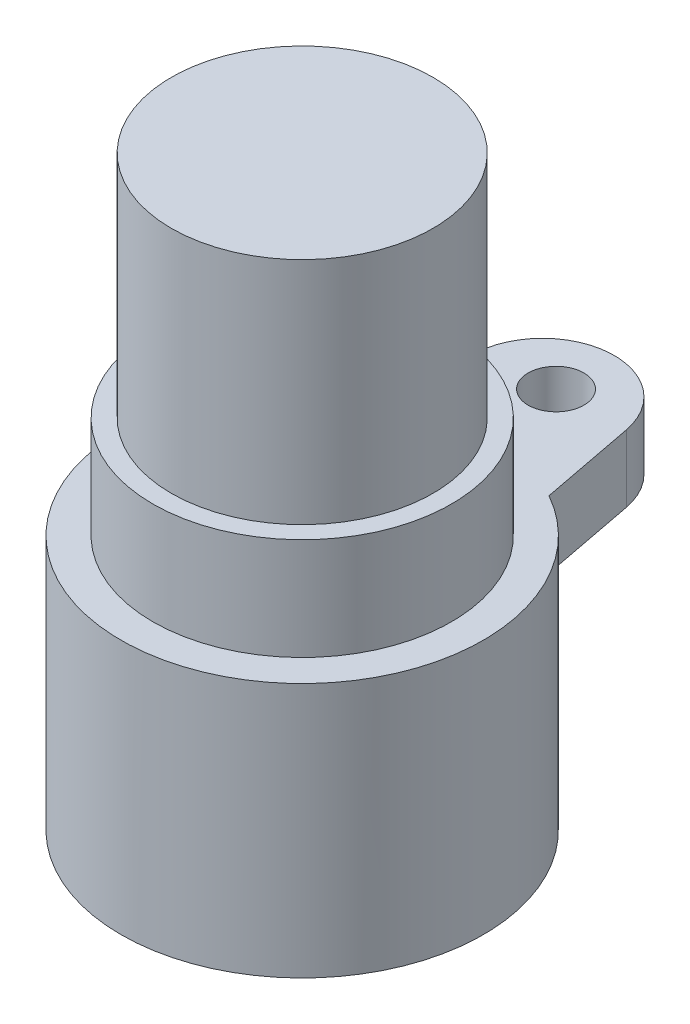
ISO-10303-21;
HEADER;
FILE_DESCRIPTION(('STEP AP214'),'2;1');
FILE_NAME('part.step','',(''),(''),'','','');
FILE_SCHEMA(('AUTOMOTIVE_DESIGN { 1 0 10303 214 1 1 1 1 }'));
ENDSEC;
DATA;
#1=APPLICATION_CONTEXT('core data for automotive mechanical design processes');
#2=APPLICATION_PROTOCOL_DEFINITION('international standard','automotive_design',2000,#1);
#3=PRODUCT_CONTEXT('',#1,'mechanical');
#4=PRODUCT('Part','Part','',(#3));
#5=PRODUCT_RELATED_PRODUCT_CATEGORY('part','',(#4));
#6=PRODUCT_DEFINITION_FORMATION('','',#4);
#7=PRODUCT_DEFINITION_CONTEXT('part definition',#1,'design');
#8=PRODUCT_DEFINITION('design','',#6,#7);
#9=PRODUCT_DEFINITION_SHAPE('','',#8);
#10=(LENGTH_UNIT() NAMED_UNIT(*) SI_UNIT(.MILLI.,.METRE.));
#11=(NAMED_UNIT(*) PLANE_ANGLE_UNIT() SI_UNIT($,.RADIAN.));
#12=(NAMED_UNIT(*) SI_UNIT($,.STERADIAN.) SOLID_ANGLE_UNIT());
#13=UNCERTAINTY_MEASURE_WITH_UNIT(LENGTH_MEASURE(1.E-05),#10,'distance_accuracy_value','');
#14=(GEOMETRIC_REPRESENTATION_CONTEXT(3) GLOBAL_UNCERTAINTY_ASSIGNED_CONTEXT((#13)) GLOBAL_UNIT_ASSIGNED_CONTEXT((#10,
#11,#12)) REPRESENTATION_CONTEXT('',''));
#15=CARTESIAN_POINT('',(0.,0.,0.));
#16=DIRECTION('',(0.,0.,1.));
#17=DIRECTION('',(1.,0.,0.));
#18=AXIS2_PLACEMENT_3D('',#15,#16,#17);
#19=CARTESIAN_POINT('',(0.,19.,0.));
#20=DIRECTION('',(0.,-1.,0.));
#21=DIRECTION('',(0.,0.,-1.));
#22=AXIS2_PLACEMENT_3D('',#19,#20,#21);
#23=CYLINDRICAL_SURFACE('',#22,13.5);
#24=CARTESIAN_POINT('',(0.,0.,0.));
#25=DIRECTION('',(0.,1.,0.));
#26=DIRECTION('',(0.,0.,1.));
#27=AXIS2_PLACEMENT_3D('',#24,#25,#26);
#28=CIRCLE('',#27,13.5);
#29=CARTESIAN_POINT('',(0.,0.,13.5));
#30=VERTEX_POINT('',#29);
#31=EDGE_CURVE('E142',#30,#30,#28,.T.);
#32=ORIENTED_EDGE('',*,*,#31,.T.);
#33=EDGE_LOOP('',(#32));
#34=FACE_BOUND('',#33,.T.);
#35=DIRECTION('',(0.,1.,0.));
#36=VECTOR('',#35,1.);
#37=CARTESIAN_POINT('',(-6.62054859453322,13.,-11.7651322265168));
#38=LINE('',#37,#36);
#39=CARTESIAN_POINT('',(-6.62054859453322,14.,-11.7651322265168));
#40=VERTEX_POINT('',#39);
#41=CARTESIAN_POINT('',(-6.62054859453322,19.,-11.7651322265168));
#42=VERTEX_POINT('',#41);
#43=EDGE_CURVE('E107',#40,#42,#38,.T.);
#44=ORIENTED_EDGE('',*,*,#43,.F.);
#45=CARTESIAN_POINT('',(0.,5.28217121470328,0.));
#46=DIRECTION('',(0.694453386959897,0.707106781186549,0.133170917770833));
#47=DIRECTION('',(0.6944533869599,-0.707106781186546,0.133170917770833));
#48=AXIS2_PLACEMENT_3D('',#45,#46,#47);
#49=ELLIPSE('',#48,19.0918830920367,13.5);
#50=CARTESIAN_POINT('',(-5.49369234724105,13.,-12.3316399717907));
#51=VERTEX_POINT('',#50);
#52=EDGE_CURVE('E12',#40,#51,#49,.F.);
#53=ORIENTED_EDGE('',*,*,#52,.T.);
#54=CARTESIAN_POINT('',(0.,13.,0.));
#55=DIRECTION('',(0.,1.,0.));
#56=DIRECTION('',(0.,0.,1.));
#57=AXIS2_PLACEMENT_3D('',#54,#55,#56);
#58=CIRCLE('',#57,13.5);
#59=CARTESIAN_POINT('',(5.49369234724105,13.,-12.3316399717907));
#60=VERTEX_POINT('',#59);
#61=EDGE_CURVE('E123',#60,#51,#58,.T.);
#62=ORIENTED_EDGE('',*,*,#61,.F.);
#63=CARTESIAN_POINT('',(0.,5.28217121470326,0.));
#64=DIRECTION('',(0.694453386959897,-0.707106781186549,-0.133170917770833));
#65=DIRECTION('',(-0.694453386959899,-0.707106781186546,0.133170917770834));
#66=AXIS2_PLACEMENT_3D('',#63,#64,#65);
#67=ELLIPSE('',#66,19.0918830920367,13.5);
#68=CARTESIAN_POINT('',(6.62054859453322,14.,-11.7651322265168));
#69=VERTEX_POINT('',#68);
#70=EDGE_CURVE('E57',#60,#69,#67,.T.);
#71=ORIENTED_EDGE('',*,*,#70,.T.);
#72=DIRECTION('',(0.,1.,0.));
#73=VECTOR('',#72,1.);
#74=CARTESIAN_POINT('',(6.62054859453322,13.,-11.7651322265168));
#75=LINE('',#74,#73);
#76=CARTESIAN_POINT('',(6.62054859453322,19.,-11.7651322265168));
#77=VERTEX_POINT('',#76);
#78=EDGE_CURVE('E127',#69,#77,#75,.T.);
#79=ORIENTED_EDGE('',*,*,#78,.T.);
#80=CARTESIAN_POINT('',(0.,19.,0.));
#81=DIRECTION('',(0.,1.,0.));
#82=DIRECTION('',(0.,0.,1.));
#83=AXIS2_PLACEMENT_3D('',#80,#81,#82);
#84=CIRCLE('',#83,13.5);
#85=EDGE_CURVE('E145',#42,#77,#84,.T.);
#86=ORIENTED_EDGE('',*,*,#85,.F.);
#87=EDGE_LOOP('',(#44,#53,#62,#71,#79,#86));
#88=FACE_BOUND('',#87,.T.);
#89=ADVANCED_FACE('F48',(#34,#88),#23,.T.);
#90=CARTESIAN_POINT('',(0.,19.,0.));
#91=DIRECTION('',(0.,1.,0.));
#92=DIRECTION('',(0.,0.,1.));
#93=AXIS2_PLACEMENT_3D('',#90,#91,#92);
#94=PLANE('',#93);
#95=CARTESIAN_POINT('',(0.,19.,0.));
#96=DIRECTION('',(0.,1.,0.));
#97=DIRECTION('',(0.,0.,1.));
#98=AXIS2_PLACEMENT_3D('',#95,#96,#97);
#99=CIRCLE('',#98,11.125);
#100=CARTESIAN_POINT('',(0.,19.,11.125));
#101=VERTEX_POINT('',#100);
#102=EDGE_CURVE('E139',#101,#101,#99,.T.);
#103=ORIENTED_EDGE('',*,*,#102,.F.);
#104=EDGE_LOOP('',(#103));
#105=FACE_BOUND('',#104,.T.);
#106=ORIENTED_EDGE('',*,*,#85,.T.);
#107=DIRECTION('',(-0.188332118025185,0.,-0.982105398274619));
#108=VECTOR('',#107,1.);
#109=CARTESIAN_POINT('',(8.56182671127384,19.,-1.64184715971587));
#110=LINE('',#109,#108);
#111=CARTESIAN_POINT('',(5.25,19.,-18.9122040451897));
#112=VERTEX_POINT('',#111);
#113=EDGE_CURVE('E121',#77,#112,#110,.T.);
#114=ORIENTED_EDGE('',*,*,#113,.T.);
#115=CARTESIAN_POINT('',(0.,19.,-17.9054448711038));
#116=DIRECTION('',(0.,1.,0.));
#117=DIRECTION('',(0.,0.,1.));
#118=AXIS2_PLACEMENT_3D('',#115,#116,#117);
#119=CIRCLE('',#118,5.34565842853863);
#120=CARTESIAN_POINT('',(-5.25,19.,-18.9122040451897));
#121=VERTEX_POINT('',#120);
#122=EDGE_CURVE('E105',#112,#121,#119,.T.);
#123=ORIENTED_EDGE('',*,*,#122,.T.);
#124=DIRECTION('',(0.188332118025184,0.,-0.982105398274619));
#125=VECTOR('',#124,1.);
#126=CARTESIAN_POINT('',(-8.56182671127383,19.,-1.64184715971586));
#127=LINE('',#126,#125);
#128=EDGE_CURVE('E111',#42,#121,#127,.T.);
#129=ORIENTED_EDGE('',*,*,#128,.F.);
#130=EDGE_LOOP('',(#106,#114,#123,#129));
#131=FACE_BOUND('',#130,.T.);
#132=CARTESIAN_POINT('',(0.,19.,-18.9122040451897));
#133=DIRECTION('',(0.,1.,0.));
#134=DIRECTION('',(0.,0.,1.));
#135=AXIS2_PLACEMENT_3D('',#132,#133,#134);
#136=CIRCLE('',#135,2.08);
#137=CARTESIAN_POINT('',(0.,19.,-16.8322040451897));
#138=VERTEX_POINT('',#137);
#139=EDGE_CURVE('E165',#138,#138,#136,.T.);
#140=ORIENTED_EDGE('',*,*,#139,.F.);
#141=EDGE_LOOP('',(#140));
#142=FACE_BOUND('',#141,.T.);
#143=ADVANCED_FACE('F118',(#105,#131,#142),#94,.T.);
#144=CARTESIAN_POINT('',(0.,0.,0.));
#145=DIRECTION('',(0.,1.,0.));
#146=DIRECTION('',(0.,0.,1.));
#147=AXIS2_PLACEMENT_3D('',#144,#145,#146);
#148=PLANE('',#147);
#149=ORIENTED_EDGE('',*,*,#31,.F.);
#150=EDGE_LOOP('',(#149));
#151=FACE_BOUND('',#150,.T.);
#152=ADVANCED_FACE('F207',(#151),#148,.F.);
#153=CARTESIAN_POINT('',(0.,26.6,0.));
#154=DIRECTION('',(0.,-1.,0.));
#155=DIRECTION('',(0.,0.,-1.));
#156=AXIS2_PLACEMENT_3D('',#153,#154,#155);
#157=CYLINDRICAL_SURFACE('',#156,11.125);
#158=CARTESIAN_POINT('',(0.,26.6,0.));
#159=DIRECTION('',(0.,1.,0.));
#160=DIRECTION('',(0.,0.,1.));
#161=AXIS2_PLACEMENT_3D('',#158,#159,#160);
#162=CIRCLE('',#161,11.125);
#163=CARTESIAN_POINT('',(0.,26.6,11.125));
#164=VERTEX_POINT('',#163);
#165=EDGE_CURVE('E134',#164,#164,#162,.T.);
#166=ORIENTED_EDGE('',*,*,#165,.F.);
#167=EDGE_LOOP('',(#166));
#168=FACE_BOUND('',#167,.T.);
#169=ORIENTED_EDGE('',*,*,#102,.T.);
#170=EDGE_LOOP('',(#169));
#171=FACE_BOUND('',#170,.T.);
#172=ADVANCED_FACE('F278',(#168,#171),#157,.T.);
#173=CARTESIAN_POINT('',(0.,26.6,0.));
#174=DIRECTION('',(0.,1.,0.));
#175=DIRECTION('',(0.,0.,1.));
#176=AXIS2_PLACEMENT_3D('',#173,#174,#175);
#177=PLANE('',#176);
#178=CARTESIAN_POINT('',(0.,26.6,0.));
#179=DIRECTION('',(0.,1.,0.));
#180=DIRECTION('',(0.,0.,1.));
#181=AXIS2_PLACEMENT_3D('',#178,#179,#180);
#182=CIRCLE('',#181,9.75);
#183=CARTESIAN_POINT('',(0.,26.6,9.75));
#184=VERTEX_POINT('',#183);
#185=EDGE_CURVE('E135',#184,#184,#182,.T.);
#186=ORIENTED_EDGE('',*,*,#185,.F.);
#187=EDGE_LOOP('',(#186));
#188=FACE_BOUND('',#187,.T.);
#189=ORIENTED_EDGE('',*,*,#165,.T.);
#190=EDGE_LOOP('',(#189));
#191=FACE_BOUND('',#190,.T.);
#192=ADVANCED_FACE('F270',(#188,#191),#177,.T.);
#193=CARTESIAN_POINT('',(0.,43.7,0.));
#194=DIRECTION('',(0.,-1.,0.));
#195=DIRECTION('',(0.,0.,-1.));
#196=AXIS2_PLACEMENT_3D('',#193,#194,#195);
#197=CYLINDRICAL_SURFACE('',#196,9.75);
#198=CARTESIAN_POINT('',(0.,43.7,0.));
#199=DIRECTION('',(0.,1.,0.));
#200=DIRECTION('',(0.,0.,1.));
#201=AXIS2_PLACEMENT_3D('',#198,#199,#200);
#202=CIRCLE('',#201,9.75);
#203=CARTESIAN_POINT('',(0.,43.7,9.75));
#204=VERTEX_POINT('',#203);
#205=EDGE_CURVE('E131',#204,#204,#202,.T.);
#206=ORIENTED_EDGE('',*,*,#205,.F.);
#207=EDGE_LOOP('',(#206));
#208=FACE_BOUND('',#207,.T.);
#209=ORIENTED_EDGE('',*,*,#185,.T.);
#210=EDGE_LOOP('',(#209));
#211=FACE_BOUND('',#210,.T.);
#212=ADVANCED_FACE('F263',(#208,#211),#197,.T.);
#213=CARTESIAN_POINT('',(0.,43.7,0.));
#214=DIRECTION('',(0.,1.,0.));
#215=DIRECTION('',(0.,0.,1.));
#216=AXIS2_PLACEMENT_3D('',#213,#214,#215);
#217=PLANE('',#216);
#218=ORIENTED_EDGE('',*,*,#205,.T.);
#219=EDGE_LOOP('',(#218));
#220=FACE_BOUND('',#219,.T.);
#221=ADVANCED_FACE('F246',(#220),#217,.T.);
#222=CARTESIAN_POINT('',(-8.56182671127383,13.,-1.64184715971586));
#223=DIRECTION('',(0.982105398274619,0.,0.188332118025184));
#224=DIRECTION('',(0.188332118025184,0.,-0.982105398274619));
#225=AXIS2_PLACEMENT_3D('',#222,#223,#224);
#226=PLANE('',#225);
#227=DIRECTION('',(0.,1.,0.));
#228=VECTOR('',#227,1.);
#229=CARTESIAN_POINT('',(-5.25,13.,-18.9122040451897));
#230=LINE('',#229,#228);
#231=CARTESIAN_POINT('',(-5.25,14.,-18.9122040451897));
#232=VERTEX_POINT('',#231);
#233=EDGE_CURVE('E101',#232,#121,#230,.T.);
#234=ORIENTED_EDGE('',*,*,#233,.F.);
#235=DIRECTION('',(-0.188332118025184,0.,0.982105398274619));
#236=VECTOR('',#235,1.);
#237=CARTESIAN_POINT('',(-8.56182671127383,14.,-1.64184715971586));
#238=LINE('',#237,#236);
#239=EDGE_CURVE('E65',#232,#40,#238,.T.);
#240=ORIENTED_EDGE('',*,*,#239,.T.);
#241=ORIENTED_EDGE('',*,*,#43,.T.);
#242=ORIENTED_EDGE('',*,*,#128,.T.);
#243=EDGE_LOOP('',(#234,#240,#241,#242));
#244=FACE_BOUND('',#243,.T.);
#245=ADVANCED_FACE('F112',(#244),#226,.F.);
#246=CARTESIAN_POINT('',(0.,13.,-17.9054448711038));
#247=DIRECTION('',(0.,1.,0.));
#248=DIRECTION('',(0.,0.,1.));
#249=AXIS2_PLACEMENT_3D('',#246,#247,#248);
#250=CYLINDRICAL_SURFACE('',#249,5.34565842853863);
#251=DIRECTION('',(0.,1.,0.));
#252=VECTOR('',#251,1.);
#253=CARTESIAN_POINT('',(5.25,13.,-18.9122040451897));
#254=LINE('',#253,#252);
#255=CARTESIAN_POINT('',(5.25,14.,-18.9122040451897));
#256=VERTEX_POINT('',#255);
#257=EDGE_CURVE('E108',#256,#112,#254,.T.);
#258=ORIENTED_EDGE('',*,*,#257,.F.);
#259=CARTESIAN_POINT('',(0.,14.,-17.9054448711038));
#260=DIRECTION('',(0.,1.,0.));
#261=DIRECTION('',(0.,0.,1.));
#262=AXIS2_PLACEMENT_3D('',#259,#260,#261);
#263=CIRCLE('',#262,5.34565842853863);
#264=EDGE_CURVE('E73',#256,#232,#263,.T.);
#265=ORIENTED_EDGE('',*,*,#264,.T.);
#266=ORIENTED_EDGE('',*,*,#233,.T.);
#267=ORIENTED_EDGE('',*,*,#122,.F.);
#268=EDGE_LOOP('',(#258,#265,#266,#267));
#269=FACE_BOUND('',#268,.T.);
#270=ADVANCED_FACE('F103',(#269),#250,.T.);
#271=CARTESIAN_POINT('',(8.56182671127384,13.,-1.64184715971587));
#272=DIRECTION('',(0.982105398274619,0.,-0.188332118025185));
#273=DIRECTION('',(-0.188332118025185,0.,-0.982105398274619));
#274=AXIS2_PLACEMENT_3D('',#271,#272,#273);
#275=PLANE('',#274);
#276=ORIENTED_EDGE('',*,*,#78,.F.);
#277=DIRECTION('',(-0.188332118025185,0.,-0.982105398274619));
#278=VECTOR('',#277,1.);
#279=CARTESIAN_POINT('',(5.25,14.,-18.9122040451897));
#280=LINE('',#279,#278);
#281=EDGE_CURVE('E138',#69,#256,#280,.T.);
#282=ORIENTED_EDGE('',*,*,#281,.T.);
#283=ORIENTED_EDGE('',*,*,#257,.T.);
#284=ORIENTED_EDGE('',*,*,#113,.F.);
#285=EDGE_LOOP('',(#276,#282,#283,#284));
#286=FACE_BOUND('',#285,.T.);
#287=ADVANCED_FACE('F188',(#286),#275,.T.);
#288=CARTESIAN_POINT('',(0.,13.,0.));
#289=DIRECTION('',(0.,1.,0.));
#290=DIRECTION('',(0.,0.,1.));
#291=AXIS2_PLACEMENT_3D('',#288,#289,#290);
#292=PLANE('',#291);
#293=CARTESIAN_POINT('',(0.,13.,-18.9122040451897));
#294=DIRECTION('',(0.,1.,0.));
#295=DIRECTION('',(0.,0.,1.));
#296=AXIS2_PLACEMENT_3D('',#293,#294,#295);
#297=CIRCLE('',#296,2.08);
#298=CARTESIAN_POINT('',(0.,13.,-16.8322040451897));
#299=VERTEX_POINT('',#298);
#300=EDGE_CURVE('E116',#299,#299,#297,.T.);
#301=ORIENTED_EDGE('',*,*,#300,.T.);
#302=EDGE_LOOP('',(#301));
#303=FACE_BOUND('',#302,.T.);
#304=CARTESIAN_POINT('',(0.,13.,-17.9054448711038));
#305=DIRECTION('',(0.,1.,0.));
#306=DIRECTION('',(0.,0.,1.));
#307=AXIS2_PLACEMENT_3D('',#304,#305,#306);
#308=CIRCLE('',#307,4.3456584285386);
#309=CARTESIAN_POINT('',(-4.26789460172536,13.,-18.7238719271645));
#310=VERTEX_POINT('',#309);
#311=CARTESIAN_POINT('',(4.26789460172536,13.,-18.7238719271645));
#312=VERTEX_POINT('',#311);
#313=EDGE_CURVE('E151',#310,#312,#308,.F.);
#314=ORIENTED_EDGE('',*,*,#313,.T.);
#315=DIRECTION('',(0.188332118025185,0.,0.982105398274619));
#316=VECTOR('',#315,1.);
#317=CARTESIAN_POINT('',(5.63844319625858,13.,-11.5768001084916));
#318=LINE('',#317,#316);
#319=EDGE_CURVE('E155',#312,#60,#318,.T.);
#320=ORIENTED_EDGE('',*,*,#319,.T.);
#321=ORIENTED_EDGE('',*,*,#61,.T.);
#322=DIRECTION('',(0.188332118025184,0.,-0.982105398274619));
#323=VECTOR('',#322,1.);
#324=CARTESIAN_POINT('',(-7.57972131299919,13.,-1.45351504169067));
#325=LINE('',#324,#323);
#326=EDGE_CURVE('E153',#51,#310,#325,.T.);
#327=ORIENTED_EDGE('',*,*,#326,.T.);
#328=EDGE_LOOP('',(#314,#320,#321,#327));
#329=FACE_BOUND('',#328,.T.);
#330=ADVANCED_FACE('F179',(#303,#329),#292,.F.);
#331=CARTESIAN_POINT('',(0.,13.,-18.9122040451897));
#332=DIRECTION('',(0.,1.,0.));
#333=DIRECTION('',(0.,0.,1.));
#334=AXIS2_PLACEMENT_3D('',#331,#332,#333);
#335=CYLINDRICAL_SURFACE('',#334,2.08);
#336=ORIENTED_EDGE('',*,*,#300,.F.);
#337=EDGE_LOOP('',(#336));
#338=FACE_BOUND('',#337,.T.);
#339=ORIENTED_EDGE('',*,*,#139,.T.);
#340=EDGE_LOOP('',(#339));
#341=FACE_BOUND('',#340,.T.);
#342=ADVANCED_FACE('F195',(#338,#341),#335,.F.);
#343=CARTESIAN_POINT('',(-7.57972131299919,13.,-1.45351504169067));
#344=DIRECTION('',(0.694453386959897,0.707106781186549,0.133170917770833));
#345=DIRECTION('',(0.188332118025184,0.,-0.982105398274619));
#346=AXIS2_PLACEMENT_3D('',#343,#344,#345);
#347=PLANE('',#346);
#348=ORIENTED_EDGE('',*,*,#52,.F.);
#349=ORIENTED_EDGE('',*,*,#239,.F.);
#350=DIRECTION('',(-0.6944533869599,0.707106781186546,-0.133170917770834));
#351=VECTOR('',#350,1.);
#352=CARTESIAN_POINT('',(-4.26789460172536,13.,-18.7238719271645));
#353=LINE('',#352,#351);
#354=EDGE_CURVE('E52',#310,#232,#353,.T.);
#355=ORIENTED_EDGE('',*,*,#354,.F.);
#356=ORIENTED_EDGE('',*,*,#326,.F.);
#357=EDGE_LOOP('',(#348,#349,#355,#356));
#358=FACE_BOUND('',#357,.T.);
#359=ADVANCED_FACE('F50',(#358),#347,.F.);
#360=CARTESIAN_POINT('',(0.,14.,-17.9054448711038));
#361=DIRECTION('',(0.,1.,0.));
#362=DIRECTION('',(0.,0.,1.));
#363=AXIS2_PLACEMENT_3D('',#360,#361,#362);
#364=CONICAL_SURFACE('',#363,5.34565842853863,0.785398163397451);
#365=ORIENTED_EDGE('',*,*,#354,.T.);
#366=ORIENTED_EDGE('',*,*,#264,.F.);
#367=DIRECTION('',(0.6944533869599,0.707106781186546,-0.133170917770834));
#368=VECTOR('',#367,1.);
#369=CARTESIAN_POINT('',(4.26789460172536,13.,-18.7238719271645));
#370=LINE('',#369,#368);
#371=EDGE_CURVE('E159',#312,#256,#370,.T.);
#372=ORIENTED_EDGE('',*,*,#371,.F.);
#373=ORIENTED_EDGE('',*,*,#313,.F.);
#374=EDGE_LOOP('',(#365,#366,#372,#373));
#375=FACE_BOUND('',#374,.T.);
#376=ADVANCED_FACE('F184',(#375),#364,.T.);
#377=CARTESIAN_POINT('',(8.56182671127384,14.,-1.64184715971587));
#378=DIRECTION('',(0.694453386959897,-0.707106781186549,-0.133170917770833));
#379=DIRECTION('',(0.188332118025185,0.,0.982105398274619));
#380=AXIS2_PLACEMENT_3D('',#377,#378,#379);
#381=PLANE('',#380);
#382=ORIENTED_EDGE('',*,*,#70,.F.);
#383=ORIENTED_EDGE('',*,*,#319,.F.);
#384=ORIENTED_EDGE('',*,*,#371,.T.);
#385=ORIENTED_EDGE('',*,*,#281,.F.);
#386=EDGE_LOOP('',(#382,#383,#384,#385));
#387=FACE_BOUND('',#386,.T.);
#388=ADVANCED_FACE('F185',(#387),#381,.T.);
#389=CLOSED_SHELL('',(#89,#143,#152,#172,#192,#212,#221,#245,#270,#287,#330,#342,#359,#376,#388));
#390=MANIFOLD_SOLID_BREP('B2',#389);
#391=ADVANCED_BREP_SHAPE_REPRESENTATION('',(#18,#390),#14);
#392=SHAPE_DEFINITION_REPRESENTATION(#9,#391);
ENDSEC;
END-ISO-10303-21;
